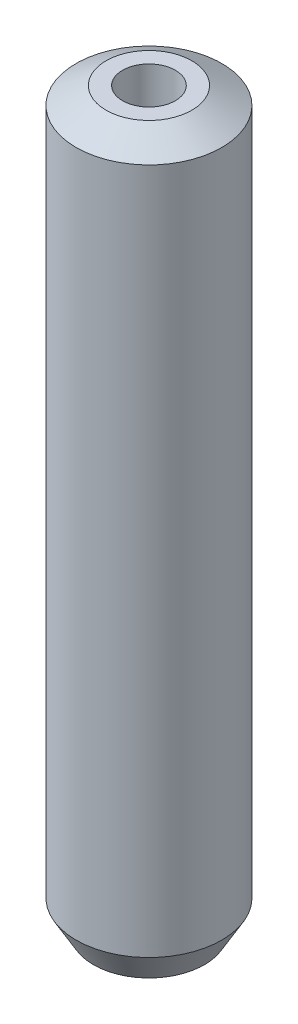
ISO-10303-21;
HEADER;
FILE_DESCRIPTION(('STEP AP214'),'2;1');
FILE_NAME('part.step','',(''),(''),'','','');
FILE_SCHEMA(('AUTOMOTIVE_DESIGN { 1 0 10303 214 1 1 1 1 }'));
ENDSEC;
DATA;
#1=APPLICATION_CONTEXT('core data for automotive mechanical design processes');
#2=APPLICATION_PROTOCOL_DEFINITION('international standard','automotive_design',2000,#1);
#3=PRODUCT_CONTEXT('',#1,'mechanical');
#4=PRODUCT('Part','Part','',(#3));
#5=PRODUCT_RELATED_PRODUCT_CATEGORY('part','',(#4));
#6=PRODUCT_DEFINITION_FORMATION('','',#4);
#7=PRODUCT_DEFINITION_CONTEXT('part definition',#1,'design');
#8=PRODUCT_DEFINITION('design','',#6,#7);
#9=PRODUCT_DEFINITION_SHAPE('','',#8);
#10=(LENGTH_UNIT() NAMED_UNIT(*) SI_UNIT(.MILLI.,.METRE.));
#11=(NAMED_UNIT(*) PLANE_ANGLE_UNIT() SI_UNIT($,.RADIAN.));
#12=(NAMED_UNIT(*) SI_UNIT($,.STERADIAN.) SOLID_ANGLE_UNIT());
#13=UNCERTAINTY_MEASURE_WITH_UNIT(LENGTH_MEASURE(1.E-05),#10,'distance_accuracy_value','');
#14=(GEOMETRIC_REPRESENTATION_CONTEXT(3) GLOBAL_UNCERTAINTY_ASSIGNED_CONTEXT((#13)) GLOBAL_UNIT_ASSIGNED_CONTEXT((#10,
#11,#12)) REPRESENTATION_CONTEXT('',''));
#15=CARTESIAN_POINT('',(0.,0.,0.));
#16=DIRECTION('',(0.,0.,1.));
#17=DIRECTION('',(1.,0.,0.));
#18=AXIS2_PLACEMENT_3D('',#15,#16,#17);
#19=CARTESIAN_POINT('',(0.,226.603959032753,0.));
#20=DIRECTION('',(0.,-1.,0.));
#21=DIRECTION('',(0.,0.,-1.));
#22=AXIS2_PLACEMENT_3D('',#19,#20,#21);
#23=CYLINDRICAL_SURFACE('',#22,22.5);
#24=CARTESIAN_POINT('',(0.,221.258437609443,0.));
#25=DIRECTION('',(0.,1.,0.));
#26=DIRECTION('',(0.,0.,1.));
#27=AXIS2_PLACEMENT_3D('',#24,#25,#26);
#28=CIRCLE('',#27,22.5);
#29=CARTESIAN_POINT('',(0.,221.258437609443,22.5));
#30=VERTEX_POINT('',#29);
#31=EDGE_CURVE('E50',#30,#30,#28,.F.);
#32=ORIENTED_EDGE('',*,*,#31,.T.);
#33=EDGE_LOOP('',(#32));
#34=FACE_BOUND('',#33,.T.);
#35=CARTESIAN_POINT('',(0.,9.25871469812123,0.));
#36=DIRECTION('',(0.,1.,0.));
#37=DIRECTION('',(0.,0.,1.));
#38=AXIS2_PLACEMENT_3D('',#35,#36,#37);
#39=CIRCLE('',#38,22.5);
#40=CARTESIAN_POINT('',(0.,9.25871469812123,22.5));
#41=VERTEX_POINT('',#40);
#42=EDGE_CURVE('E51',#41,#41,#39,.T.);
#43=ORIENTED_EDGE('',*,*,#42,.T.);
#44=EDGE_LOOP('',(#43));
#45=FACE_BOUND('',#44,.T.);
#46=ADVANCED_FACE('F39',(#34,#45),#23,.T.);
#47=CARTESIAN_POINT('',(0.,226.603959032753,0.));
#48=DIRECTION('',(0.,1.,0.));
#49=DIRECTION('',(0.,0.,1.));
#50=AXIS2_PLACEMENT_3D('',#47,#48,#49);
#51=PLANE('',#50);
#52=CARTESIAN_POINT('',(0.,226.603959032753,0.));
#53=DIRECTION('',(0.,1.,0.));
#54=DIRECTION('',(0.,0.,1.));
#55=AXIS2_PLACEMENT_3D('',#52,#53,#54);
#56=CIRCLE('',#55,13.2412853018788);
#57=CARTESIAN_POINT('',(0.,226.603959032753,13.2412853018788));
#58=VERTEX_POINT('',#57);
#59=EDGE_CURVE('E54',#58,#58,#56,.T.);
#60=ORIENTED_EDGE('',*,*,#59,.T.);
#61=EDGE_LOOP('',(#60));
#62=FACE_BOUND('',#61,.T.);
#63=CARTESIAN_POINT('',(0.,226.603959032753,0.));
#64=DIRECTION('',(0.,1.,0.));
#65=DIRECTION('',(0.,0.,1.));
#66=AXIS2_PLACEMENT_3D('',#63,#64,#65);
#67=CIRCLE('',#66,8.15985067327172);
#68=CARTESIAN_POINT('',(0.,226.603959032753,8.15985067327172));
#69=VERTEX_POINT('',#68);
#70=EDGE_CURVE('E58',#69,#69,#67,.T.);
#71=ORIENTED_EDGE('',*,*,#70,.F.);
#72=EDGE_LOOP('',(#71));
#73=FACE_BOUND('',#72,.T.);
#74=ADVANCED_FACE('F69',(#62,#73),#51,.T.);
#75=CARTESIAN_POINT('',(0.,0.,0.));
#76=DIRECTION('',(0.,1.,0.));
#77=DIRECTION('',(0.,0.,1.));
#78=AXIS2_PLACEMENT_3D('',#75,#76,#77);
#79=PLANE('',#78);
#80=CARTESIAN_POINT('',(0.,0.,0.));
#81=DIRECTION('',(0.,1.,0.));
#82=DIRECTION('',(0.,0.,1.));
#83=AXIS2_PLACEMENT_3D('',#80,#81,#82);
#84=CIRCLE('',#83,17.1544785766897);
#85=CARTESIAN_POINT('',(0.,0.,17.1544785766897));
#86=VERTEX_POINT('',#85);
#87=EDGE_CURVE('E10',#86,#86,#84,.F.);
#88=ORIENTED_EDGE('',*,*,#87,.T.);
#89=EDGE_LOOP('',(#88));
#90=FACE_BOUND('',#89,.T.);
#91=CARTESIAN_POINT('',(0.,0.,0.));
#92=DIRECTION('',(0.,1.,0.));
#93=DIRECTION('',(0.,0.,1.));
#94=AXIS2_PLACEMENT_3D('',#91,#92,#93);
#95=CIRCLE('',#94,8.15985067327172);
#96=CARTESIAN_POINT('',(0.,0.,8.15985067327172));
#97=VERTEX_POINT('',#96);
#98=EDGE_CURVE('E63',#97,#97,#95,.T.);
#99=ORIENTED_EDGE('',*,*,#98,.T.);
#100=EDGE_LOOP('',(#99));
#101=FACE_BOUND('',#100,.T.);
#102=ADVANCED_FACE('F75',(#90,#101),#79,.F.);
#103=CARTESIAN_POINT('',(0.,226.603959032753,0.));
#104=DIRECTION('',(0.,-1.,0.));
#105=DIRECTION('',(0.,0.,-1.));
#106=AXIS2_PLACEMENT_3D('',#103,#104,#105);
#107=CYLINDRICAL_SURFACE('',#106,8.15985067327172);
#108=ORIENTED_EDGE('',*,*,#70,.T.);
#109=EDGE_LOOP('',(#108));
#110=FACE_BOUND('',#109,.T.);
#111=ORIENTED_EDGE('',*,*,#98,.F.);
#112=EDGE_LOOP('',(#111));
#113=FACE_BOUND('',#112,.T.);
#114=ADVANCED_FACE('F70',(#110,#113),#107,.F.);
#115=CARTESIAN_POINT('',(0.,226.603959032753,0.));
#116=DIRECTION('',(0.,-1.,0.));
#117=DIRECTION('',(0.,0.,-1.));
#118=AXIS2_PLACEMENT_3D('',#115,#116,#117);
#119=CONICAL_SURFACE('',#118,13.2412853018788,1.04719755119659);
#120=ORIENTED_EDGE('',*,*,#31,.F.);
#121=EDGE_LOOP('',(#120));
#122=FACE_BOUND('',#121,.T.);
#123=ORIENTED_EDGE('',*,*,#59,.F.);
#124=EDGE_LOOP('',(#123));
#125=FACE_BOUND('',#124,.T.);
#126=ADVANCED_FACE('F81',(#122,#125),#119,.T.);
#127=CARTESIAN_POINT('',(0.,9.25871469812123,0.));
#128=DIRECTION('',(0.,1.,0.));
#129=DIRECTION('',(0.,0.,1.));
#130=AXIS2_PLACEMENT_3D('',#127,#128,#129);
#131=CONICAL_SURFACE('',#130,22.5,0.523598775598302);
#132=ORIENTED_EDGE('',*,*,#87,.F.);
#133=EDGE_LOOP('',(#132));
#134=FACE_BOUND('',#133,.T.);
#135=ORIENTED_EDGE('',*,*,#42,.F.);
#136=EDGE_LOOP('',(#135));
#137=FACE_BOUND('',#136,.T.);
#138=ADVANCED_FACE('F45',(#134,#137),#131,.T.);
#139=CLOSED_SHELL('',(#46,#74,#102,#114,#126,#138));
#140=MANIFOLD_SOLID_BREP('B2',#139);
#141=ADVANCED_BREP_SHAPE_REPRESENTATION('',(#18,#140),#14);
#142=SHAPE_DEFINITION_REPRESENTATION(#9,#141);
ENDSEC;
END-ISO-10303-21;
